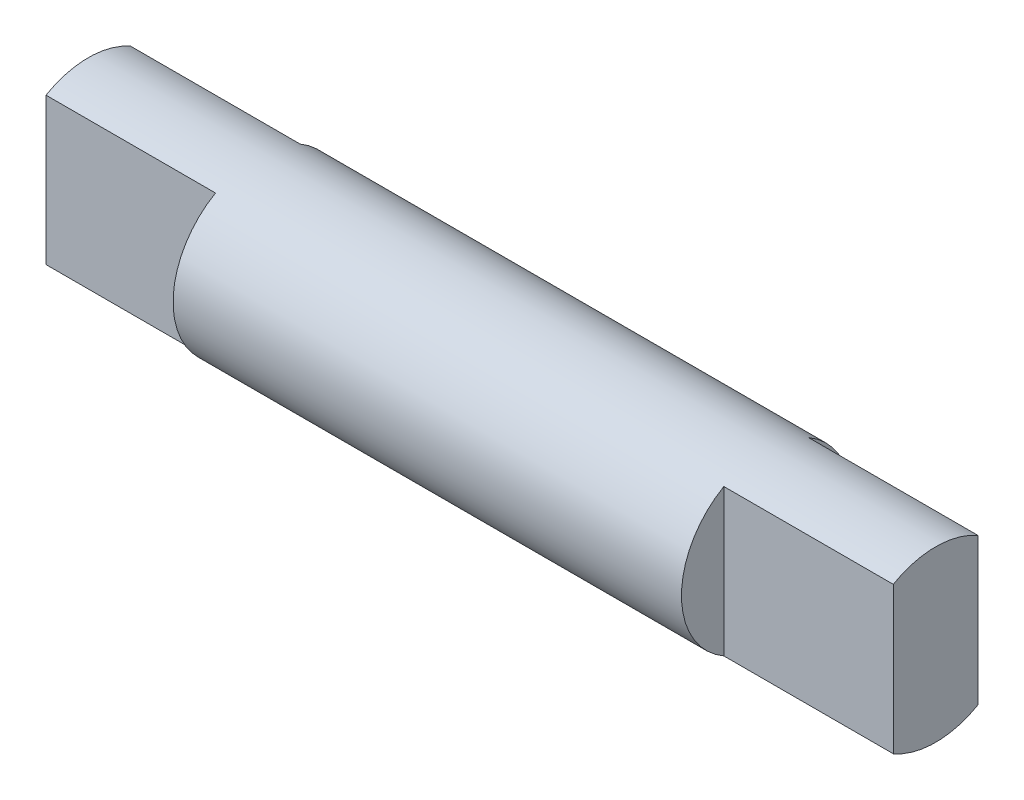
ISO-10303-21;
HEADER;
FILE_DESCRIPTION(('STEP AP214'),'2;1');
FILE_NAME('part.step','',(''),(''),'','','');
FILE_SCHEMA(('AUTOMOTIVE_DESIGN { 1 0 10303 214 1 1 1 1 }'));
ENDSEC;
DATA;
#1=APPLICATION_CONTEXT('core data for automotive mechanical design processes');
#2=APPLICATION_PROTOCOL_DEFINITION('international standard','automotive_design',2000,#1);
#3=PRODUCT_CONTEXT('',#1,'mechanical');
#4=PRODUCT('Part','Part','',(#3));
#5=PRODUCT_RELATED_PRODUCT_CATEGORY('part','',(#4));
#6=PRODUCT_DEFINITION_FORMATION('','',#4);
#7=PRODUCT_DEFINITION_CONTEXT('part definition',#1,'design');
#8=PRODUCT_DEFINITION('design','',#6,#7);
#9=PRODUCT_DEFINITION_SHAPE('','',#8);
#10=(LENGTH_UNIT() NAMED_UNIT(*) SI_UNIT(.MILLI.,.METRE.));
#11=(NAMED_UNIT(*) PLANE_ANGLE_UNIT() SI_UNIT($,.RADIAN.));
#12=(NAMED_UNIT(*) SI_UNIT($,.STERADIAN.) SOLID_ANGLE_UNIT());
#13=UNCERTAINTY_MEASURE_WITH_UNIT(LENGTH_MEASURE(1.E-05),#10,'distance_accuracy_value','');
#14=(GEOMETRIC_REPRESENTATION_CONTEXT(3) GLOBAL_UNCERTAINTY_ASSIGNED_CONTEXT((#13)) GLOBAL_UNIT_ASSIGNED_CONTEXT((#10,
#11,#12)) REPRESENTATION_CONTEXT('',''));
#15=CARTESIAN_POINT('',(0.,0.,0.));
#16=DIRECTION('',(0.,0.,1.));
#17=DIRECTION('',(1.,0.,0.));
#18=AXIS2_PLACEMENT_3D('',#15,#16,#17);
#19=CARTESIAN_POINT('',(-45.,0.,0.));
#20=DIRECTION('',(1.,0.,0.));
#21=DIRECTION('',(0.,0.,-1.));
#22=AXIS2_PLACEMENT_3D('',#19,#20,#21);
#23=CYLINDRICAL_SURFACE('',#22,5.);
#24=CARTESIAN_POINT('',(-5.00000000000003,0.,0.));
#25=DIRECTION('',(-1.,0.,0.));
#26=DIRECTION('',(0.,0.,1.));
#27=AXIS2_PLACEMENT_3D('',#24,#25,#26);
#28=CIRCLE('',#27,5.);
#29=CARTESIAN_POINT('',(-5.00000000000003,4.33012701892219,2.5));
#30=VERTEX_POINT('',#29);
#31=CARTESIAN_POINT('',(-5.00000000000003,-4.33012701892219,2.5));
#32=VERTEX_POINT('',#31);
#33=EDGE_CURVE('E11',#30,#32,#28,.F.);
#34=ORIENTED_EDGE('',*,*,#33,.F.);
#35=DIRECTION('',(1.,0.,0.));
#36=VECTOR('',#35,1.);
#37=CARTESIAN_POINT('',(-45.,4.33012701892219,2.50000000000001));
#38=LINE('',#37,#36);
#39=CARTESIAN_POINT('',(4.99999999999997,4.33012701892219,2.5));
#40=VERTEX_POINT('',#39);
#41=EDGE_CURVE('E158',#40,#30,#38,.F.);
#42=ORIENTED_EDGE('',*,*,#41,.F.);
#43=CARTESIAN_POINT('',(5.,0.,0.));
#44=DIRECTION('',(1.,0.,0.));
#45=DIRECTION('',(0.,0.,-1.));
#46=AXIS2_PLACEMENT_3D('',#43,#44,#45);
#47=CIRCLE('',#46,5.);
#48=CARTESIAN_POINT('',(5.,4.33012701892219,-2.5));
#49=VERTEX_POINT('',#48);
#50=EDGE_CURVE('E128',#49,#40,#47,.T.);
#51=ORIENTED_EDGE('',*,*,#50,.F.);
#52=DIRECTION('',(1.,0.,0.));
#53=VECTOR('',#52,1.);
#54=CARTESIAN_POINT('',(-45.,4.3301270189222,-2.49999999999999));
#55=LINE('',#54,#53);
#56=CARTESIAN_POINT('',(-5.00000000000003,4.33012701892219,-2.5));
#57=VERTEX_POINT('',#56);
#58=EDGE_CURVE('E111',#57,#49,#55,.T.);
#59=ORIENTED_EDGE('',*,*,#58,.F.);
#60=CARTESIAN_POINT('',(-5.00000000000003,0.,0.));
#61=DIRECTION('',(-1.,0.,0.));
#62=DIRECTION('',(0.,0.,1.));
#63=AXIS2_PLACEMENT_3D('',#60,#61,#62);
#64=CIRCLE('',#63,5.);
#65=CARTESIAN_POINT('',(-5.00000000000003,-4.33012701892219,-2.5));
#66=VERTEX_POINT('',#65);
#67=EDGE_CURVE('E46',#66,#57,#64,.F.);
#68=ORIENTED_EDGE('',*,*,#67,.F.);
#69=DIRECTION('',(1.,0.,0.));
#70=VECTOR('',#69,1.);
#71=CARTESIAN_POINT('',(-45.,-4.3301270189222,-2.49999999999999));
#72=LINE('',#71,#70);
#73=CARTESIAN_POINT('',(4.99999999999997,-4.33012701892219,-2.5));
#74=VERTEX_POINT('',#73);
#75=EDGE_CURVE('E108',#74,#66,#72,.F.);
#76=ORIENTED_EDGE('',*,*,#75,.F.);
#77=CARTESIAN_POINT('',(5.,-4.33012701892219,2.5));
#78=VERTEX_POINT('',#77);
#79=EDGE_CURVE('E123',#78,#74,#47,.T.);
#80=ORIENTED_EDGE('',*,*,#79,.F.);
#81=DIRECTION('',(1.,0.,0.));
#82=VECTOR('',#81,1.);
#83=CARTESIAN_POINT('',(-45.,-4.33012701892219,2.50000000000001));
#84=LINE('',#83,#82);
#85=EDGE_CURVE('E124',#32,#78,#84,.T.);
#86=ORIENTED_EDGE('',*,*,#85,.F.);
#87=EDGE_LOOP('',(#34,#42,#51,#59,#68,#76,#80,#86));
#88=FACE_BOUND('',#87,.T.);
#89=DIRECTION('',(1.,0.,0.));
#90=VECTOR('',#89,1.);
#91=CARTESIAN_POINT('',(-45.,-4.33012701892219,-2.5));
#92=LINE('',#91,#90);
#93=CARTESIAN_POINT('',(-35.,-4.33012701892219,-2.5));
#94=VERTEX_POINT('',#93);
#95=CARTESIAN_POINT('',(-45.,-4.33012701892219,-2.5));
#96=VERTEX_POINT('',#95);
#97=EDGE_CURVE('E53',#94,#96,#92,.F.);
#98=ORIENTED_EDGE('',*,*,#97,.F.);
#99=CARTESIAN_POINT('',(-35.,0.,0.));
#100=DIRECTION('',(1.,0.,0.));
#101=DIRECTION('',(0.,0.,-1.));
#102=AXIS2_PLACEMENT_3D('',#99,#100,#101);
#103=CIRCLE('',#102,5.);
#104=CARTESIAN_POINT('',(-35.,4.33012701892219,-2.5));
#105=VERTEX_POINT('',#104);
#106=EDGE_CURVE('E144',#105,#94,#103,.F.);
#107=ORIENTED_EDGE('',*,*,#106,.F.);
#108=DIRECTION('',(1.,0.,0.));
#109=VECTOR('',#108,1.);
#110=CARTESIAN_POINT('',(-45.,4.33012701892219,-2.5));
#111=LINE('',#110,#109);
#112=CARTESIAN_POINT('',(-45.,4.33012701892219,-2.5));
#113=VERTEX_POINT('',#112);
#114=EDGE_CURVE('E131',#113,#105,#111,.T.);
#115=ORIENTED_EDGE('',*,*,#114,.F.);
#116=CARTESIAN_POINT('',(-45.,0.,0.));
#117=DIRECTION('',(1.,0.,0.));
#118=DIRECTION('',(0.,0.,-1.));
#119=AXIS2_PLACEMENT_3D('',#116,#117,#118);
#120=CIRCLE('',#119,5.);
#121=CARTESIAN_POINT('',(-45.,4.33012701892219,2.5));
#122=VERTEX_POINT('',#121);
#123=EDGE_CURVE('E117',#113,#122,#120,.T.);
#124=ORIENTED_EDGE('',*,*,#123,.T.);
#125=DIRECTION('',(1.,0.,0.));
#126=VECTOR('',#125,1.);
#127=CARTESIAN_POINT('',(-45.,4.33012701892219,2.5));
#128=LINE('',#127,#126);
#129=CARTESIAN_POINT('',(-35.,4.33012701892219,2.5));
#130=VERTEX_POINT('',#129);
#131=EDGE_CURVE('E61',#130,#122,#128,.F.);
#132=ORIENTED_EDGE('',*,*,#131,.F.);
#133=CARTESIAN_POINT('',(-35.,0.,0.));
#134=DIRECTION('',(1.,0.,0.));
#135=DIRECTION('',(0.,0.,-1.));
#136=AXIS2_PLACEMENT_3D('',#133,#134,#135);
#137=CIRCLE('',#136,5.);
#138=CARTESIAN_POINT('',(-35.,-4.33012701892219,2.5));
#139=VERTEX_POINT('',#138);
#140=EDGE_CURVE('E142',#139,#130,#137,.F.);
#141=ORIENTED_EDGE('',*,*,#140,.F.);
#142=DIRECTION('',(1.,0.,0.));
#143=VECTOR('',#142,1.);
#144=CARTESIAN_POINT('',(-45.,-4.33012701892219,2.5));
#145=LINE('',#144,#143);
#146=CARTESIAN_POINT('',(-45.,-4.33012701892219,2.5));
#147=VERTEX_POINT('',#146);
#148=EDGE_CURVE('E161',#147,#139,#145,.T.);
#149=ORIENTED_EDGE('',*,*,#148,.F.);
#150=EDGE_CURVE('E130',#147,#96,#120,.T.);
#151=ORIENTED_EDGE('',*,*,#150,.T.);
#152=EDGE_LOOP('',(#98,#107,#115,#124,#132,#141,#149,#151));
#153=FACE_BOUND('',#152,.T.);
#154=ADVANCED_FACE('F39',(#88,#153),#23,.T.);
#155=CARTESIAN_POINT('',(-45.,0.,0.));
#156=DIRECTION('',(1.,0.,0.));
#157=DIRECTION('',(0.,0.,-1.));
#158=AXIS2_PLACEMENT_3D('',#155,#156,#157);
#159=PLANE('',#158);
#160=ORIENTED_EDGE('',*,*,#123,.F.);
#161=DIRECTION('',(0.,-1.,0.));
#162=VECTOR('',#161,1.);
#163=CARTESIAN_POINT('',(-45.,0.,-2.5));
#164=LINE('',#163,#162);
#165=EDGE_CURVE('E140',#113,#96,#164,.T.);
#166=ORIENTED_EDGE('',*,*,#165,.T.);
#167=ORIENTED_EDGE('',*,*,#150,.F.);
#168=DIRECTION('',(0.,1.,0.));
#169=VECTOR('',#168,1.);
#170=CARTESIAN_POINT('',(-45.,0.,2.5));
#171=LINE('',#170,#169);
#172=EDGE_CURVE('E138',#147,#122,#171,.T.);
#173=ORIENTED_EDGE('',*,*,#172,.T.);
#174=EDGE_LOOP('',(#160,#166,#167,#173));
#175=FACE_BOUND('',#174,.T.);
#176=ADVANCED_FACE('F176',(#175),#159,.F.);
#177=CARTESIAN_POINT('',(5.,0.,0.));
#178=DIRECTION('',(1.,0.,0.));
#179=DIRECTION('',(0.,0.,-1.));
#180=AXIS2_PLACEMENT_3D('',#177,#178,#179);
#181=PLANE('',#180);
#182=DIRECTION('',(0.,1.,0.));
#183=VECTOR('',#182,1.);
#184=CARTESIAN_POINT('',(5.,0.,2.5));
#185=LINE('',#184,#183);
#186=EDGE_CURVE('E116',#78,#40,#185,.T.);
#187=ORIENTED_EDGE('',*,*,#186,.F.);
#188=ORIENTED_EDGE('',*,*,#79,.T.);
#189=DIRECTION('',(0.,-1.,0.));
#190=VECTOR('',#189,1.);
#191=CARTESIAN_POINT('',(5.,0.,-2.5));
#192=LINE('',#191,#190);
#193=EDGE_CURVE('E104',#49,#74,#192,.T.);
#194=ORIENTED_EDGE('',*,*,#193,.F.);
#195=ORIENTED_EDGE('',*,*,#50,.T.);
#196=EDGE_LOOP('',(#187,#188,#194,#195));
#197=FACE_BOUND('',#196,.T.);
#198=ADVANCED_FACE('F127',(#197),#181,.T.);
#199=CARTESIAN_POINT('',(4.99999999999997,-5.,-2.5));
#200=DIRECTION('',(0.,0.,1.));
#201=DIRECTION('',(1.,0.,0.));
#202=AXIS2_PLACEMENT_3D('',#199,#200,#201);
#203=PLANE('',#202);
#204=ORIENTED_EDGE('',*,*,#75,.T.);
#205=DIRECTION('',(0.,1.,0.));
#206=VECTOR('',#205,1.);
#207=CARTESIAN_POINT('',(-5.00000000000003,-5.,-2.5));
#208=LINE('',#207,#206);
#209=EDGE_CURVE('E147',#66,#57,#208,.T.);
#210=ORIENTED_EDGE('',*,*,#209,.T.);
#211=ORIENTED_EDGE('',*,*,#58,.T.);
#212=ORIENTED_EDGE('',*,*,#193,.T.);
#213=EDGE_LOOP('',(#204,#210,#211,#212));
#214=FACE_BOUND('',#213,.T.);
#215=ADVANCED_FACE('F106',(#214),#203,.F.);
#216=CARTESIAN_POINT('',(-5.00000000000003,-5.,-5.));
#217=DIRECTION('',(-1.,0.,0.));
#218=DIRECTION('',(0.,0.,1.));
#219=AXIS2_PLACEMENT_3D('',#216,#217,#218);
#220=PLANE('',#219);
#221=ORIENTED_EDGE('',*,*,#209,.F.);
#222=ORIENTED_EDGE('',*,*,#67,.T.);
#223=EDGE_LOOP('',(#221,#222));
#224=FACE_BOUND('',#223,.T.);
#225=ADVANCED_FACE('F146',(#224),#220,.F.);
#226=CARTESIAN_POINT('',(-5.00000000000003,-5.,5.));
#227=DIRECTION('',(-1.,0.,0.));
#228=DIRECTION('',(0.,0.,1.));
#229=AXIS2_PLACEMENT_3D('',#226,#227,#228);
#230=PLANE('',#229);
#231=ORIENTED_EDGE('',*,*,#33,.T.);
#232=DIRECTION('',(0.,1.,0.));
#233=VECTOR('',#232,1.);
#234=CARTESIAN_POINT('',(-5.00000000000003,-5.,2.5));
#235=LINE('',#234,#233);
#236=EDGE_CURVE('E149',#32,#30,#235,.T.);
#237=ORIENTED_EDGE('',*,*,#236,.T.);
#238=EDGE_LOOP('',(#231,#237));
#239=FACE_BOUND('',#238,.T.);
#240=ADVANCED_FACE('F205',(#239),#230,.F.);
#241=CARTESIAN_POINT('',(4.99999999999997,-5.,2.5));
#242=DIRECTION('',(0.,0.,-1.));
#243=DIRECTION('',(-1.,0.,0.));
#244=AXIS2_PLACEMENT_3D('',#241,#242,#243);
#245=PLANE('',#244);
#246=ORIENTED_EDGE('',*,*,#41,.T.);
#247=ORIENTED_EDGE('',*,*,#236,.F.);
#248=ORIENTED_EDGE('',*,*,#85,.T.);
#249=ORIENTED_EDGE('',*,*,#186,.T.);
#250=EDGE_LOOP('',(#246,#247,#248,#249));
#251=FACE_BOUND('',#250,.T.);
#252=ADVANCED_FACE('F188',(#251),#245,.F.);
#253=CARTESIAN_POINT('',(-45.,-5.,2.5));
#254=DIRECTION('',(0.,0.,-1.));
#255=DIRECTION('',(-1.,0.,0.));
#256=AXIS2_PLACEMENT_3D('',#253,#254,#255);
#257=PLANE('',#256);
#258=ORIENTED_EDGE('',*,*,#131,.T.);
#259=ORIENTED_EDGE('',*,*,#172,.F.);
#260=ORIENTED_EDGE('',*,*,#148,.T.);
#261=DIRECTION('',(0.,1.,0.));
#262=VECTOR('',#261,1.);
#263=CARTESIAN_POINT('',(-35.,-5.,2.5));
#264=LINE('',#263,#262);
#265=EDGE_CURVE('E152',#139,#130,#264,.T.);
#266=ORIENTED_EDGE('',*,*,#265,.T.);
#267=EDGE_LOOP('',(#258,#259,#260,#266));
#268=FACE_BOUND('',#267,.T.);
#269=ADVANCED_FACE('F179',(#268),#257,.F.);
#270=CARTESIAN_POINT('',(-35.,-5.,5.));
#271=DIRECTION('',(1.,0.,0.));
#272=DIRECTION('',(0.,0.,-1.));
#273=AXIS2_PLACEMENT_3D('',#270,#271,#272);
#274=PLANE('',#273);
#275=ORIENTED_EDGE('',*,*,#265,.F.);
#276=ORIENTED_EDGE('',*,*,#140,.T.);
#277=EDGE_LOOP('',(#275,#276));
#278=FACE_BOUND('',#277,.T.);
#279=ADVANCED_FACE('F180',(#278),#274,.F.);
#280=CARTESIAN_POINT('',(-35.,-5.,-5.));
#281=DIRECTION('',(1.,0.,0.));
#282=DIRECTION('',(0.,0.,-1.));
#283=AXIS2_PLACEMENT_3D('',#280,#281,#282);
#284=PLANE('',#283);
#285=ORIENTED_EDGE('',*,*,#106,.T.);
#286=DIRECTION('',(0.,1.,0.));
#287=VECTOR('',#286,1.);
#288=CARTESIAN_POINT('',(-35.,-5.,-2.5));
#289=LINE('',#288,#287);
#290=EDGE_CURVE('E148',#94,#105,#289,.T.);
#291=ORIENTED_EDGE('',*,*,#290,.T.);
#292=EDGE_LOOP('',(#285,#291));
#293=FACE_BOUND('',#292,.T.);
#294=ADVANCED_FACE('F171',(#293),#284,.F.);
#295=CARTESIAN_POINT('',(-45.,-5.,-2.5));
#296=DIRECTION('',(0.,0.,1.));
#297=DIRECTION('',(1.,0.,0.));
#298=AXIS2_PLACEMENT_3D('',#295,#296,#297);
#299=PLANE('',#298);
#300=ORIENTED_EDGE('',*,*,#97,.T.);
#301=ORIENTED_EDGE('',*,*,#165,.F.);
#302=ORIENTED_EDGE('',*,*,#114,.T.);
#303=ORIENTED_EDGE('',*,*,#290,.F.);
#304=EDGE_LOOP('',(#300,#301,#302,#303));
#305=FACE_BOUND('',#304,.T.);
#306=ADVANCED_FACE('F166',(#305),#299,.F.);
#307=CLOSED_SHELL('',(#154,#176,#198,#215,#225,#240,#252,#269,#279,#294,#306));
#308=MANIFOLD_SOLID_BREP('B2',#307);
#309=ADVANCED_BREP_SHAPE_REPRESENTATION('',(#18,#308),#14);
#310=SHAPE_DEFINITION_REPRESENTATION(#9,#309);
ENDSEC;
END-ISO-10303-21;
